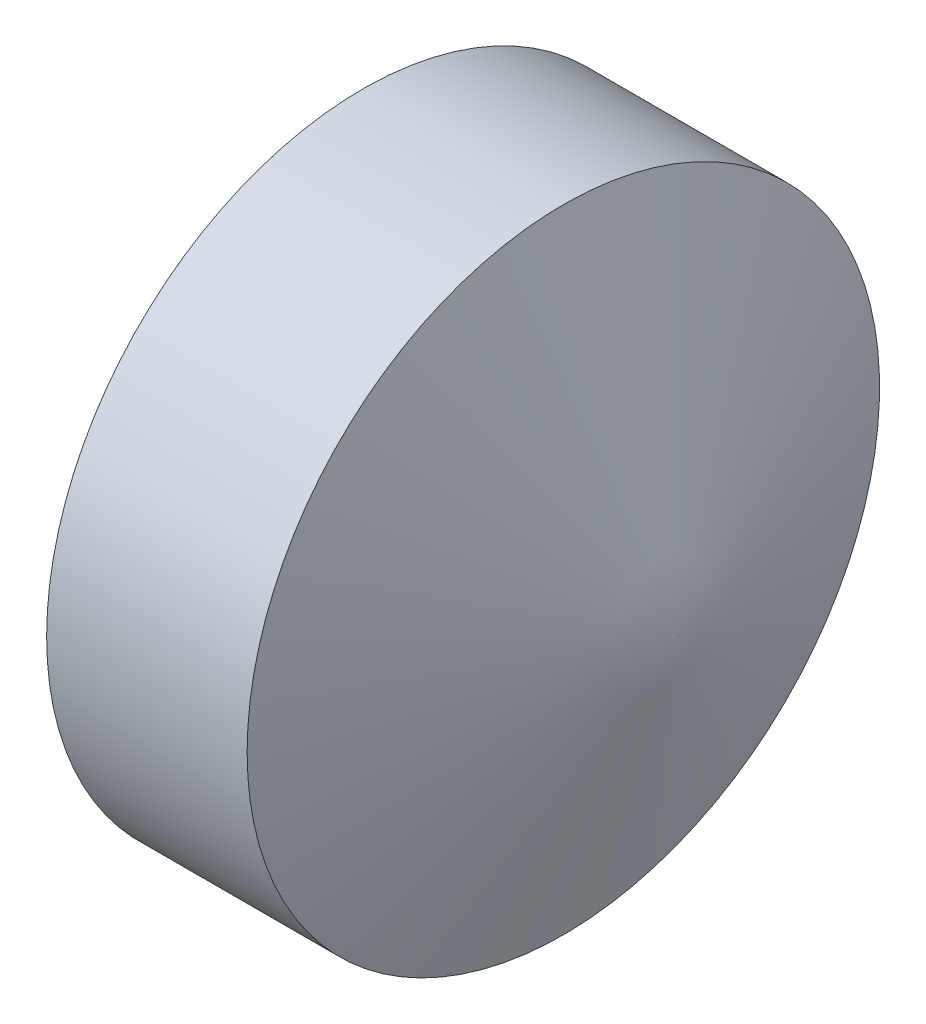
ISO-10303-21;
HEADER;
FILE_DESCRIPTION(('STEP AP214'),'2;1');
FILE_NAME('part.step','',(''),(''),'','','');
FILE_SCHEMA(('AUTOMOTIVE_DESIGN { 1 0 10303 214 1 1 1 1 }'));
ENDSEC;
DATA;
#1=APPLICATION_CONTEXT('core data for automotive mechanical design processes');
#2=APPLICATION_PROTOCOL_DEFINITION('international standard','automotive_design',2000,#1);
#3=PRODUCT_CONTEXT('',#1,'mechanical');
#4=PRODUCT('Part','Part','',(#3));
#5=PRODUCT_RELATED_PRODUCT_CATEGORY('part','',(#4));
#6=PRODUCT_DEFINITION_FORMATION('','',#4);
#7=PRODUCT_DEFINITION_CONTEXT('part definition',#1,'design');
#8=PRODUCT_DEFINITION('design','',#6,#7);
#9=PRODUCT_DEFINITION_SHAPE('','',#8);
#10=(LENGTH_UNIT() NAMED_UNIT(*) SI_UNIT(.MILLI.,.METRE.));
#11=(NAMED_UNIT(*) PLANE_ANGLE_UNIT() SI_UNIT($,.RADIAN.));
#12=(NAMED_UNIT(*) SI_UNIT($,.STERADIAN.) SOLID_ANGLE_UNIT());
#13=UNCERTAINTY_MEASURE_WITH_UNIT(LENGTH_MEASURE(1.E-05),#10,'distance_accuracy_value','');
#14=(GEOMETRIC_REPRESENTATION_CONTEXT(3) GLOBAL_UNCERTAINTY_ASSIGNED_CONTEXT((#13)) GLOBAL_UNIT_ASSIGNED_CONTEXT((#10,
#11,#12)) REPRESENTATION_CONTEXT('',''));
#15=CARTESIAN_POINT('',(0.,0.,0.));
#16=DIRECTION('',(0.,0.,1.));
#17=DIRECTION('',(1.,0.,0.));
#18=AXIS2_PLACEMENT_3D('',#15,#16,#17);
#19=CARTESIAN_POINT('',(3.,0.,0.));
#20=DIRECTION('',(-1.,0.,0.));
#21=DIRECTION('',(0.,0.,1.));
#22=AXIS2_PLACEMENT_3D('',#19,#20,#21);
#23=CYLINDRICAL_SURFACE('',#22,1.35632946891562);
#24=CARTESIAN_POINT('',(1.64635829323957,0.,0.));
#25=DIRECTION('',(-1.,0.,0.));
#26=DIRECTION('',(0.,0.,1.));
#27=AXIS2_PLACEMENT_3D('',#24,#25,#26);
#28=CIRCLE('',#27,1.35632946891562);
#29=CARTESIAN_POINT('',(1.64635829323957,0.,1.35632946891562));
#30=VERTEX_POINT('',#29);
#31=EDGE_CURVE('E11',#30,#30,#28,.F.);
#32=ORIENTED_EDGE('',*,*,#31,.T.);
#33=EDGE_LOOP('',(#32));
#34=FACE_BOUND('',#33,.T.);
#35=CARTESIAN_POINT('',(2.50633644545662,0.,0.));
#36=DIRECTION('',(-1.,0.,0.));
#37=DIRECTION('',(0.,0.,1.));
#38=AXIS2_PLACEMENT_3D('',#35,#36,#37);
#39=CIRCLE('',#38,1.35632946891562);
#40=CARTESIAN_POINT('',(2.50633644545662,0.,1.35632946891562));
#41=VERTEX_POINT('',#40);
#42=EDGE_CURVE('E132',#41,#41,#39,.T.);
#43=ORIENTED_EDGE('',*,*,#42,.T.);
#44=EDGE_LOOP('',(#43));
#45=FACE_BOUND('',#44,.T.);
#46=ADVANCED_FACE('F32',(#34,#45),#23,.T.);
#47=CARTESIAN_POINT('',(1.5,0.,0.));
#48=DIRECTION('',(-1.,0.,0.));
#49=DIRECTION('',(0.,0.,1.));
#50=AXIS2_PLACEMENT_3D('',#47,#48,#49);
#51=PLANE('',#50);
#52=CARTESIAN_POINT('',(1.5,0.,0.));
#53=DIRECTION('',(-1.,0.,0.));
#54=DIRECTION('',(0.,0.,1.));
#55=AXIS2_PLACEMENT_3D('',#52,#53,#54);
#56=CIRCLE('',#55,1.10282946891562);
#57=CARTESIAN_POINT('',(1.5,0.,1.10282946891562));
#58=VERTEX_POINT('',#57);
#59=EDGE_CURVE('E40',#58,#58,#56,.T.);
#60=ORIENTED_EDGE('',*,*,#59,.T.);
#61=EDGE_LOOP('',(#60));
#62=FACE_BOUND('',#61,.T.);
#63=DIRECTION('',(0.,0.,1.));
#64=VECTOR('',#63,1.);
#65=CARTESIAN_POINT('',(1.5,-0.65,-0.375277674973259));
#66=LINE('',#65,#64);
#67=CARTESIAN_POINT('',(1.5,-0.65,-0.375277674973259));
#68=VERTEX_POINT('',#67);
#69=CARTESIAN_POINT('',(1.5,-0.65,0.375277674973254));
#70=VERTEX_POINT('',#69);
#71=EDGE_CURVE('E47',#68,#70,#66,.T.);
#72=ORIENTED_EDGE('',*,*,#71,.F.);
#73=DIRECTION('',(0.,-0.866025403784439,0.499999999999999));
#74=VECTOR('',#73,1.);
#75=CARTESIAN_POINT('',(1.5,0.,-0.750555349946517));
#76=LINE('',#75,#74);
#77=CARTESIAN_POINT('',(1.5,0.,-0.750555349946517));
#78=VERTEX_POINT('',#77);
#79=EDGE_CURVE('E106',#78,#68,#76,.T.);
#80=ORIENTED_EDGE('',*,*,#79,.F.);
#81=DIRECTION('',(0.,-0.866025403784437,-0.500000000000002));
#82=VECTOR('',#81,1.);
#83=CARTESIAN_POINT('',(1.5,0.65,-0.37527767497326));
#84=LINE('',#83,#82);
#85=CARTESIAN_POINT('',(1.5,0.65,-0.37527767497326));
#86=VERTEX_POINT('',#85);
#87=EDGE_CURVE('E109',#86,#78,#84,.T.);
#88=ORIENTED_EDGE('',*,*,#87,.F.);
#89=DIRECTION('',(0.,0.,-1.));
#90=VECTOR('',#89,1.);
#91=CARTESIAN_POINT('',(1.5,0.65,0.375277674973253));
#92=LINE('',#91,#90);
#93=CARTESIAN_POINT('',(1.5,0.65,0.375277674973253));
#94=VERTEX_POINT('',#93);
#95=EDGE_CURVE('E125',#94,#86,#92,.T.);
#96=ORIENTED_EDGE('',*,*,#95,.F.);
#97=DIRECTION('',(0.,0.866025403784437,-0.500000000000002));
#98=VECTOR('',#97,1.);
#99=CARTESIAN_POINT('',(1.5,0.,0.75055534994651));
#100=LINE('',#99,#98);
#101=CARTESIAN_POINT('',(1.5,0.,0.75055534994651));
#102=VERTEX_POINT('',#101);
#103=EDGE_CURVE('E122',#102,#94,#100,.T.);
#104=ORIENTED_EDGE('',*,*,#103,.F.);
#105=DIRECTION('',(0.,0.86602540378444,0.499999999999997));
#106=VECTOR('',#105,1.);
#107=CARTESIAN_POINT('',(1.5,-0.65,0.375277674973254));
#108=LINE('',#107,#106);
#109=EDGE_CURVE('E120',#70,#102,#108,.T.);
#110=ORIENTED_EDGE('',*,*,#109,.F.);
#111=EDGE_LOOP('',(#72,#80,#88,#96,#104,#110));
#112=FACE_BOUND('',#111,.T.);
#113=ADVANCED_FACE('F144',(#62,#112),#51,.T.);
#114=CARTESIAN_POINT('',(2.50633644545662,0.,0.));
#115=DIRECTION('',(-1.,0.,0.));
#116=DIRECTION('',(0.,0.,1.));
#117=AXIS2_PLACEMENT_3D('',#114,#115,#116);
#118=CONICAL_SURFACE('',#117,1.35632946891562,1.22173047639603);
#119=CARTESIAN_POINT('',(3.,0.,0.));
#120=VERTEX_POINT('',#119);
#121=VERTEX_LOOP('',#120);
#122=FACE_BOUND('',#121,.T.);
#123=ORIENTED_EDGE('',*,*,#42,.F.);
#124=EDGE_LOOP('',(#123));
#125=FACE_BOUND('',#124,.T.);
#126=ADVANCED_FACE('F159',(#122,#125),#118,.T.);
#127=CARTESIAN_POINT('',(2.7,-0.65,-0.375277674973259));
#128=DIRECTION('',(0.,-1.,0.));
#129=DIRECTION('',(0.,0.,-1.));
#130=AXIS2_PLACEMENT_3D('',#127,#128,#129);
#131=PLANE('',#130);
#132=ORIENTED_EDGE('',*,*,#71,.T.);
#133=DIRECTION('',(-1.,0.,0.));
#134=VECTOR('',#133,1.);
#135=CARTESIAN_POINT('',(2.7,-0.65,0.375277674973254));
#136=LINE('',#135,#134);
#137=CARTESIAN_POINT('',(2.7,-0.65,0.375277674973254));
#138=VERTEX_POINT('',#137);
#139=EDGE_CURVE('E83',#138,#70,#136,.T.);
#140=ORIENTED_EDGE('',*,*,#139,.F.);
#141=DIRECTION('',(0.,0.,1.));
#142=VECTOR('',#141,1.);
#143=CARTESIAN_POINT('',(2.7,-0.65,-0.375277674973259));
#144=LINE('',#143,#142);
#145=CARTESIAN_POINT('',(2.7,-0.65,-0.375277674973259));
#146=VERTEX_POINT('',#145);
#147=EDGE_CURVE('E87',#146,#138,#144,.T.);
#148=ORIENTED_EDGE('',*,*,#147,.F.);
#149=DIRECTION('',(-1.,0.,0.));
#150=VECTOR('',#149,1.);
#151=CARTESIAN_POINT('',(2.7,-0.65,-0.375277674973259));
#152=LINE('',#151,#150);
#153=EDGE_CURVE('E130',#146,#68,#152,.T.);
#154=ORIENTED_EDGE('',*,*,#153,.T.);
#155=EDGE_LOOP('',(#132,#140,#148,#154));
#156=FACE_BOUND('',#155,.T.);
#157=ADVANCED_FACE('F85',(#156),#131,.F.);
#158=CARTESIAN_POINT('',(2.7,0.,-0.750555349946517));
#159=DIRECTION('',(0.,-0.499999999999999,-0.866025403784439));
#160=DIRECTION('',(0.,0.866025403784439,-0.499999999999999));
#161=AXIS2_PLACEMENT_3D('',#158,#159,#160);
#162=PLANE('',#161);
#163=ORIENTED_EDGE('',*,*,#79,.T.);
#164=ORIENTED_EDGE('',*,*,#153,.F.);
#165=DIRECTION('',(0.,-0.866025403784439,0.499999999999999));
#166=VECTOR('',#165,1.);
#167=CARTESIAN_POINT('',(2.7,0.,-0.750555349946517));
#168=LINE('',#167,#166);
#169=CARTESIAN_POINT('',(2.7,0.,-0.750555349946517));
#170=VERTEX_POINT('',#169);
#171=EDGE_CURVE('E93',#170,#146,#168,.T.);
#172=ORIENTED_EDGE('',*,*,#171,.F.);
#173=DIRECTION('',(-1.,0.,0.));
#174=VECTOR('',#173,1.);
#175=CARTESIAN_POINT('',(2.7,0.,-0.750555349946517));
#176=LINE('',#175,#174);
#177=EDGE_CURVE('E133',#170,#78,#176,.T.);
#178=ORIENTED_EDGE('',*,*,#177,.T.);
#179=EDGE_LOOP('',(#163,#164,#172,#178));
#180=FACE_BOUND('',#179,.T.);
#181=ADVANCED_FACE('F167',(#180),#162,.F.);
#182=CARTESIAN_POINT('',(2.7,0.65,-0.37527767497326));
#183=DIRECTION('',(0.,0.500000000000002,-0.866025403784437));
#184=DIRECTION('',(0.,0.866025403784437,0.500000000000002));
#185=AXIS2_PLACEMENT_3D('',#182,#183,#184);
#186=PLANE('',#185);
#187=ORIENTED_EDGE('',*,*,#87,.T.);
#188=ORIENTED_EDGE('',*,*,#177,.F.);
#189=DIRECTION('',(0.,-0.866025403784437,-0.500000000000002));
#190=VECTOR('',#189,1.);
#191=CARTESIAN_POINT('',(2.7,0.65,-0.37527767497326));
#192=LINE('',#191,#190);
#193=CARTESIAN_POINT('',(2.7,0.65,-0.37527767497326));
#194=VERTEX_POINT('',#193);
#195=EDGE_CURVE('E116',#194,#170,#192,.T.);
#196=ORIENTED_EDGE('',*,*,#195,.F.);
#197=DIRECTION('',(-1.,0.,0.));
#198=VECTOR('',#197,1.);
#199=CARTESIAN_POINT('',(2.7,0.65,-0.37527767497326));
#200=LINE('',#199,#198);
#201=EDGE_CURVE('E135',#194,#86,#200,.T.);
#202=ORIENTED_EDGE('',*,*,#201,.T.);
#203=EDGE_LOOP('',(#187,#188,#196,#202));
#204=FACE_BOUND('',#203,.T.);
#205=ADVANCED_FACE('F177',(#204),#186,.F.);
#206=CARTESIAN_POINT('',(2.7,0.65,0.375277674973253));
#207=DIRECTION('',(0.,1.,0.));
#208=DIRECTION('',(0.,0.,1.));
#209=AXIS2_PLACEMENT_3D('',#206,#207,#208);
#210=PLANE('',#209);
#211=ORIENTED_EDGE('',*,*,#95,.T.);
#212=ORIENTED_EDGE('',*,*,#201,.F.);
#213=DIRECTION('',(0.,0.,-1.));
#214=VECTOR('',#213,1.);
#215=CARTESIAN_POINT('',(2.7,0.65,0.375277674973253));
#216=LINE('',#215,#214);
#217=CARTESIAN_POINT('',(2.7,0.65,0.375277674973253));
#218=VERTEX_POINT('',#217);
#219=EDGE_CURVE('E113',#218,#194,#216,.T.);
#220=ORIENTED_EDGE('',*,*,#219,.F.);
#221=DIRECTION('',(-1.,0.,0.));
#222=VECTOR('',#221,1.);
#223=CARTESIAN_POINT('',(2.7,0.65,0.375277674973253));
#224=LINE('',#223,#222);
#225=EDGE_CURVE('E137',#218,#94,#224,.T.);
#226=ORIENTED_EDGE('',*,*,#225,.T.);
#227=EDGE_LOOP('',(#211,#212,#220,#226));
#228=FACE_BOUND('',#227,.T.);
#229=ADVANCED_FACE('F173',(#228),#210,.F.);
#230=CARTESIAN_POINT('',(2.7,0.,0.75055534994651));
#231=DIRECTION('',(0.,0.500000000000002,0.866025403784437));
#232=DIRECTION('',(0.,-0.866025403784438,0.500000000000002));
#233=AXIS2_PLACEMENT_3D('',#230,#231,#232);
#234=PLANE('',#233);
#235=ORIENTED_EDGE('',*,*,#103,.T.);
#236=ORIENTED_EDGE('',*,*,#225,.F.);
#237=DIRECTION('',(0.,0.866025403784437,-0.500000000000002));
#238=VECTOR('',#237,1.);
#239=CARTESIAN_POINT('',(2.7,0.,0.75055534994651));
#240=LINE('',#239,#238);
#241=CARTESIAN_POINT('',(2.7,0.,0.75055534994651));
#242=VERTEX_POINT('',#241);
#243=EDGE_CURVE('E101',#242,#218,#240,.T.);
#244=ORIENTED_EDGE('',*,*,#243,.F.);
#245=DIRECTION('',(-1.,0.,0.));
#246=VECTOR('',#245,1.);
#247=CARTESIAN_POINT('',(2.7,0.,0.75055534994651));
#248=LINE('',#247,#246);
#249=EDGE_CURVE('E92',#242,#102,#248,.T.);
#250=ORIENTED_EDGE('',*,*,#249,.T.);
#251=EDGE_LOOP('',(#235,#236,#244,#250));
#252=FACE_BOUND('',#251,.T.);
#253=ADVANCED_FACE('F170',(#252),#234,.F.);
#254=CARTESIAN_POINT('',(2.7,-0.65,0.375277674973254));
#255=DIRECTION('',(0.,-0.499999999999997,0.86602540378444));
#256=DIRECTION('',(0.,-0.86602540378444,-0.499999999999997));
#257=AXIS2_PLACEMENT_3D('',#254,#255,#256);
#258=PLANE('',#257);
#259=ORIENTED_EDGE('',*,*,#109,.T.);
#260=ORIENTED_EDGE('',*,*,#249,.F.);
#261=DIRECTION('',(0.,0.86602540378444,0.499999999999997));
#262=VECTOR('',#261,1.);
#263=CARTESIAN_POINT('',(2.7,-0.65,0.375277674973254));
#264=LINE('',#263,#262);
#265=EDGE_CURVE('E96',#138,#242,#264,.T.);
#266=ORIENTED_EDGE('',*,*,#265,.F.);
#267=ORIENTED_EDGE('',*,*,#139,.T.);
#268=EDGE_LOOP('',(#259,#260,#266,#267));
#269=FACE_BOUND('',#268,.T.);
#270=ADVANCED_FACE('F97',(#269),#258,.F.);
#271=CARTESIAN_POINT('',(2.7,0.,0.));
#272=DIRECTION('',(-1.,0.,0.));
#273=DIRECTION('',(0.,0.,1.));
#274=AXIS2_PLACEMENT_3D('',#271,#272,#273);
#275=PLANE('',#274);
#276=ORIENTED_EDGE('',*,*,#147,.T.);
#277=ORIENTED_EDGE('',*,*,#265,.T.);
#278=ORIENTED_EDGE('',*,*,#243,.T.);
#279=ORIENTED_EDGE('',*,*,#219,.T.);
#280=ORIENTED_EDGE('',*,*,#195,.T.);
#281=ORIENTED_EDGE('',*,*,#171,.T.);
#282=EDGE_LOOP('',(#276,#277,#278,#279,#280,#281));
#283=FACE_BOUND('',#282,.T.);
#284=ADVANCED_FACE('F103',(#283),#275,.T.);
#285=CARTESIAN_POINT('',(1.5,0.,0.));
#286=DIRECTION('',(1.,0.,0.));
#287=DIRECTION('',(0.,0.,-1.));
#288=AXIS2_PLACEMENT_3D('',#285,#286,#287);
#289=CONICAL_SURFACE('',#288,1.10282946891562,1.0471975511966);
#290=ORIENTED_EDGE('',*,*,#31,.F.);
#291=EDGE_LOOP('',(#290));
#292=FACE_BOUND('',#291,.T.);
#293=ORIENTED_EDGE('',*,*,#59,.F.);
#294=EDGE_LOOP('',(#293));
#295=FACE_BOUND('',#294,.T.);
#296=ADVANCED_FACE('F34',(#292,#295),#289,.T.);
#297=CLOSED_SHELL('',(#46,#113,#126,#157,#181,#205,#229,#253,#270,#284,#296));
#298=MANIFOLD_SOLID_BREP('B2',#297);
#299=ADVANCED_BREP_SHAPE_REPRESENTATION('',(#18,#298),#14);
#300=SHAPE_DEFINITION_REPRESENTATION(#9,#299);
ENDSEC;
END-ISO-10303-21;
